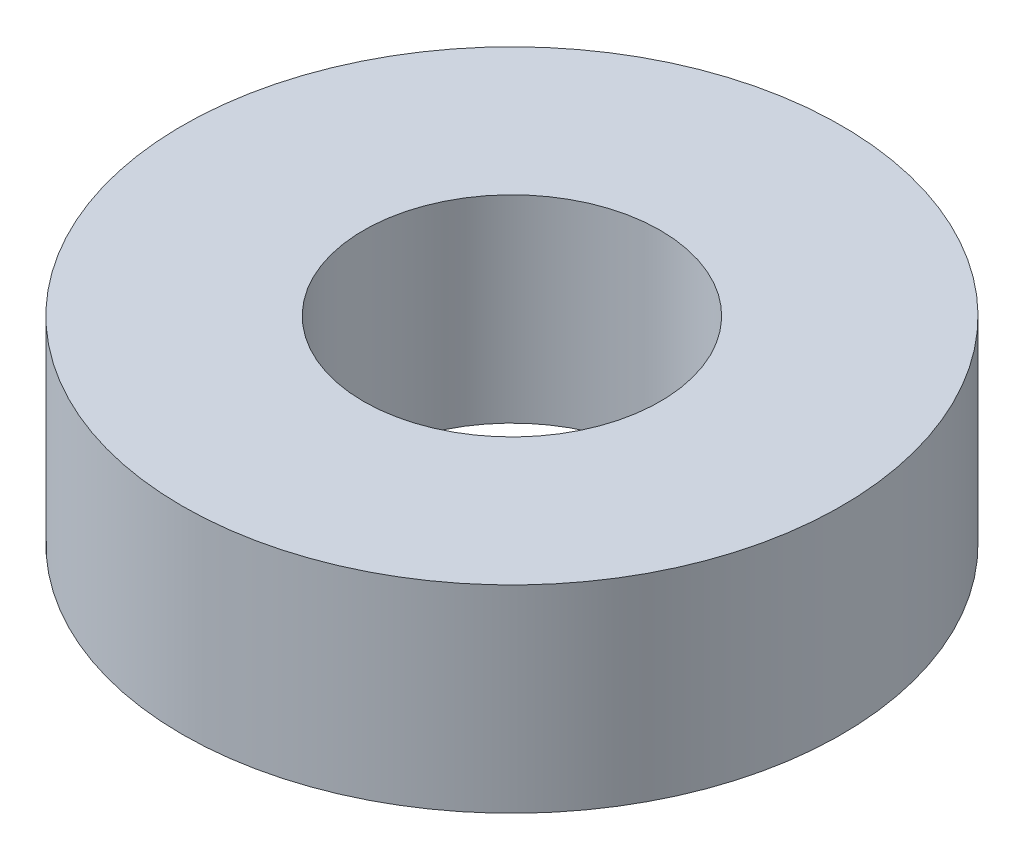
ISO-10303-21;
HEADER;
FILE_DESCRIPTION(('STEP AP214'),'2;1');
FILE_NAME('part.step','',(''),(''),'','','');
FILE_SCHEMA(('AUTOMOTIVE_DESIGN { 1 0 10303 214 1 1 1 1 }'));
ENDSEC;
DATA;
#1=APPLICATION_CONTEXT('core data for automotive mechanical design processes');
#2=APPLICATION_PROTOCOL_DEFINITION('international standard','automotive_design',2000,#1);
#3=PRODUCT_CONTEXT('',#1,'mechanical');
#4=PRODUCT('Part','Part','',(#3));
#5=PRODUCT_RELATED_PRODUCT_CATEGORY('part','',(#4));
#6=PRODUCT_DEFINITION_FORMATION('','',#4);
#7=PRODUCT_DEFINITION_CONTEXT('part definition',#1,'design');
#8=PRODUCT_DEFINITION('design','',#6,#7);
#9=PRODUCT_DEFINITION_SHAPE('','',#8);
#10=(LENGTH_UNIT() NAMED_UNIT(*) SI_UNIT(.MILLI.,.METRE.));
#11=(NAMED_UNIT(*) PLANE_ANGLE_UNIT() SI_UNIT($,.RADIAN.));
#12=(NAMED_UNIT(*) SI_UNIT($,.STERADIAN.) SOLID_ANGLE_UNIT());
#13=UNCERTAINTY_MEASURE_WITH_UNIT(LENGTH_MEASURE(1.E-05),#10,'distance_accuracy_value','');
#14=(GEOMETRIC_REPRESENTATION_CONTEXT(3) GLOBAL_UNCERTAINTY_ASSIGNED_CONTEXT((#13)) GLOBAL_UNIT_ASSIGNED_CONTEXT((#10,
#11,#12)) REPRESENTATION_CONTEXT('',''));
#15=CARTESIAN_POINT('',(0.,0.,0.));
#16=DIRECTION('',(0.,0.,1.));
#17=DIRECTION('',(1.,0.,0.));
#18=AXIS2_PLACEMENT_3D('',#15,#16,#17);
#19=CARTESIAN_POINT('',(0.,3.,0.));
#20=DIRECTION('',(0.,-1.,0.));
#21=DIRECTION('',(0.,0.,-1.));
#22=AXIS2_PLACEMENT_3D('',#19,#20,#21);
#23=CYLINDRICAL_SURFACE('',#22,5.);
#24=CARTESIAN_POINT('',(0.,3.,0.));
#25=DIRECTION('',(0.,1.,0.));
#26=DIRECTION('',(0.,0.,1.));
#27=AXIS2_PLACEMENT_3D('',#24,#25,#26);
#28=CIRCLE('',#27,5.);
#29=CARTESIAN_POINT('',(0.,3.,5.));
#30=VERTEX_POINT('',#29);
#31=EDGE_CURVE('E10',#30,#30,#28,.T.);
#32=ORIENTED_EDGE('',*,*,#31,.F.);
#33=EDGE_LOOP('',(#32));
#34=FACE_BOUND('',#33,.T.);
#35=CARTESIAN_POINT('',(0.,0.,0.));
#36=DIRECTION('',(0.,1.,0.));
#37=DIRECTION('',(0.,0.,1.));
#38=AXIS2_PLACEMENT_3D('',#35,#36,#37);
#39=CIRCLE('',#38,5.);
#40=CARTESIAN_POINT('',(0.,0.,5.));
#41=VERTEX_POINT('',#40);
#42=EDGE_CURVE('E35',#41,#41,#39,.T.);
#43=ORIENTED_EDGE('',*,*,#42,.T.);
#44=EDGE_LOOP('',(#43));
#45=FACE_BOUND('',#44,.T.);
#46=ADVANCED_FACE('F32',(#34,#45),#23,.T.);
#47=CARTESIAN_POINT('',(0.,3.,0.));
#48=DIRECTION('',(0.,1.,0.));
#49=DIRECTION('',(0.,0.,1.));
#50=AXIS2_PLACEMENT_3D('',#47,#48,#49);
#51=PLANE('',#50);
#52=CARTESIAN_POINT('',(0.,3.,0.));
#53=DIRECTION('',(0.,1.,0.));
#54=DIRECTION('',(0.,0.,1.));
#55=AXIS2_PLACEMENT_3D('',#52,#53,#54);
#56=CIRCLE('',#55,2.25);
#57=CARTESIAN_POINT('',(0.,3.,2.25));
#58=VERTEX_POINT('',#57);
#59=EDGE_CURVE('E46',#58,#58,#56,.T.);
#60=ORIENTED_EDGE('',*,*,#59,.F.);
#61=EDGE_LOOP('',(#60));
#62=FACE_BOUND('',#61,.T.);
#63=ORIENTED_EDGE('',*,*,#31,.T.);
#64=EDGE_LOOP('',(#63));
#65=FACE_BOUND('',#64,.T.);
#66=ADVANCED_FACE('F52',(#62,#65),#51,.T.);
#67=CARTESIAN_POINT('',(0.,0.,0.));
#68=DIRECTION('',(0.,1.,0.));
#69=DIRECTION('',(0.,0.,1.));
#70=AXIS2_PLACEMENT_3D('',#67,#68,#69);
#71=PLANE('',#70);
#72=CARTESIAN_POINT('',(0.,0.,0.));
#73=DIRECTION('',(0.,1.,0.));
#74=DIRECTION('',(0.,0.,1.));
#75=AXIS2_PLACEMENT_3D('',#72,#73,#74);
#76=CIRCLE('',#75,2.25);
#77=CARTESIAN_POINT('',(0.,0.,2.25));
#78=VERTEX_POINT('',#77);
#79=EDGE_CURVE('E42',#78,#78,#76,.T.);
#80=ORIENTED_EDGE('',*,*,#79,.T.);
#81=EDGE_LOOP('',(#80));
#82=FACE_BOUND('',#81,.T.);
#83=ORIENTED_EDGE('',*,*,#42,.F.);
#84=EDGE_LOOP('',(#83));
#85=FACE_BOUND('',#84,.T.);
#86=ADVANCED_FACE('F54',(#82,#85),#71,.F.);
#87=CARTESIAN_POINT('',(0.,3.,0.));
#88=DIRECTION('',(0.,1.,0.));
#89=DIRECTION('',(0.,0.,1.));
#90=AXIS2_PLACEMENT_3D('',#87,#88,#89);
#91=CYLINDRICAL_SURFACE('',#90,2.25);
#92=ORIENTED_EDGE('',*,*,#79,.F.);
#93=EDGE_LOOP('',(#92));
#94=FACE_BOUND('',#93,.T.);
#95=ORIENTED_EDGE('',*,*,#59,.T.);
#96=EDGE_LOOP('',(#95));
#97=FACE_BOUND('',#96,.T.);
#98=ADVANCED_FACE('F50',(#94,#97),#91,.F.);
#99=CLOSED_SHELL('',(#46,#66,#86,#98));
#100=MANIFOLD_SOLID_BREP('B2',#99);
#101=ADVANCED_BREP_SHAPE_REPRESENTATION('',(#18,#100),#14);
#102=SHAPE_DEFINITION_REPRESENTATION(#9,#101);
ENDSEC;
END-ISO-10303-21;
